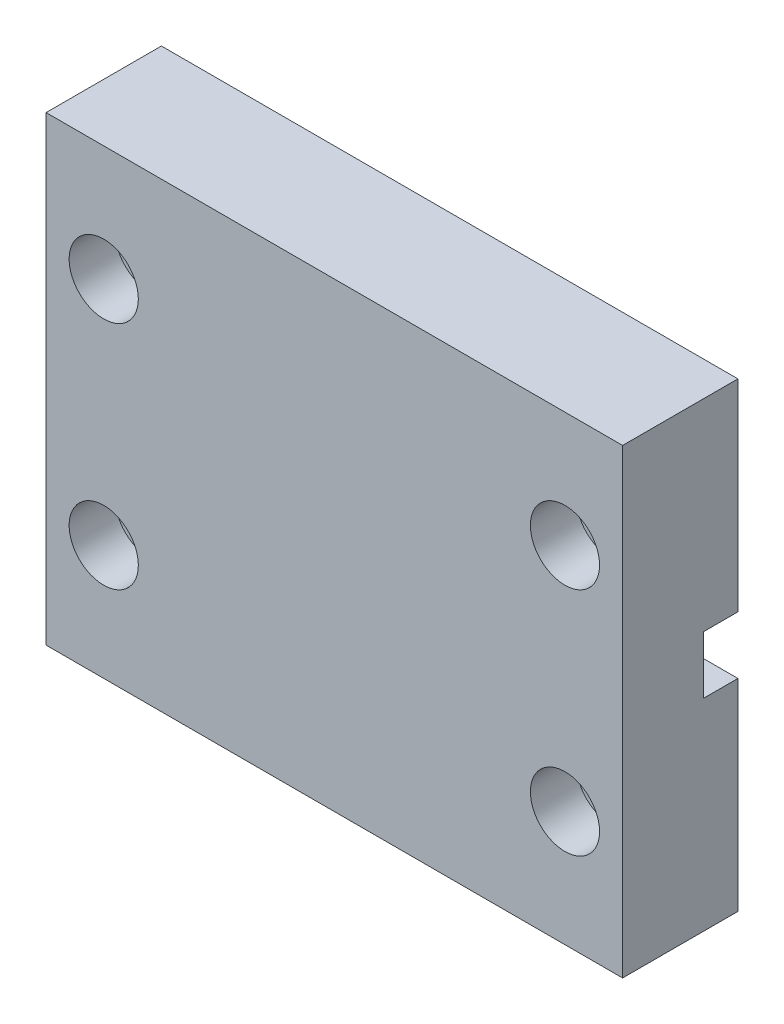
ISO-10303-21;
HEADER;
FILE_DESCRIPTION(('STEP AP214'),'2;1');
FILE_NAME('part.step','',(''),(''),'','','');
FILE_SCHEMA(('AUTOMOTIVE_DESIGN { 1 0 10303 214 1 1 1 1 }'));
ENDSEC;
DATA;
#1=APPLICATION_CONTEXT('core data for automotive mechanical design processes');
#2=APPLICATION_PROTOCOL_DEFINITION('international standard','automotive_design',2000,#1);
#3=PRODUCT_CONTEXT('',#1,'mechanical');
#4=PRODUCT('Part','Part','',(#3));
#5=PRODUCT_RELATED_PRODUCT_CATEGORY('part','',(#4));
#6=PRODUCT_DEFINITION_FORMATION('','',#4);
#7=PRODUCT_DEFINITION_CONTEXT('part definition',#1,'design');
#8=PRODUCT_DEFINITION('design','',#6,#7);
#9=PRODUCT_DEFINITION_SHAPE('','',#8);
#10=(LENGTH_UNIT() NAMED_UNIT(*) SI_UNIT(.MILLI.,.METRE.));
#11=(NAMED_UNIT(*) PLANE_ANGLE_UNIT() SI_UNIT($,.RADIAN.));
#12=(NAMED_UNIT(*) SI_UNIT($,.STERADIAN.) SOLID_ANGLE_UNIT());
#13=UNCERTAINTY_MEASURE_WITH_UNIT(LENGTH_MEASURE(1.E-05),#10,'distance_accuracy_value','');
#14=(GEOMETRIC_REPRESENTATION_CONTEXT(3) GLOBAL_UNCERTAINTY_ASSIGNED_CONTEXT((#13)) GLOBAL_UNIT_ASSIGNED_CONTEXT((#10,
#11,#12)) REPRESENTATION_CONTEXT('',''));
#15=CARTESIAN_POINT('',(0.,0.,0.));
#16=DIRECTION('',(0.,0.,1.));
#17=DIRECTION('',(1.,0.,0.));
#18=AXIS2_PLACEMENT_3D('',#15,#16,#17);
#19=CARTESIAN_POINT('',(4.55535961159553,20.8357520804533,26.2898446599827));
#20=DIRECTION('',(0.,0.,-1.));
#21=DIRECTION('',(-1.,0.,0.));
#22=AXIS2_PLACEMENT_3D('',#19,#20,#21);
#23=CYLINDRICAL_SURFACE('',#22,2.5);
#24=CARTESIAN_POINT('',(4.55535961159553,20.8357520804533,26.2898446599827));
#25=DIRECTION('',(0.,0.,-1.));
#26=DIRECTION('',(-1.,0.,0.));
#27=AXIS2_PLACEMENT_3D('',#24,#25,#26);
#28=CIRCLE('',#27,2.5);
#29=CARTESIAN_POINT('',(2.05535961159553,20.8357520804533,26.2898446599827));
#30=VERTEX_POINT('',#29);
#31=EDGE_CURVE('E177',#30,#30,#28,.T.);
#32=ORIENTED_EDGE('',*,*,#31,.F.);
#33=EDGE_LOOP('',(#32));
#34=FACE_BOUND('',#33,.T.);
#35=DIRECTION('',(0.,0.,-1.));
#36=VECTOR('',#35,1.);
#37=CARTESIAN_POINT('',(4.55535961159553,18.3357520804533,21.2898446599827));
#38=LINE('',#37,#36);
#39=CARTESIAN_POINT('',(4.55535961159553,18.3357520804533,21.2898446599827));
#40=VERTEX_POINT('',#39);
#41=CARTESIAN_POINT('',(4.55535961159553,18.3357520804533,18.2898446599827));
#42=VERTEX_POINT('',#41);
#43=EDGE_CURVE('E166',#40,#42,#38,.T.);
#44=ORIENTED_EDGE('',*,*,#43,.T.);
#45=CARTESIAN_POINT('',(4.55535961159553,20.8357520804533,18.2898446599827));
#46=DIRECTION('',(0.,0.,-1.));
#47=DIRECTION('',(-1.,0.,0.));
#48=AXIS2_PLACEMENT_3D('',#45,#46,#47);
#49=CIRCLE('',#48,2.5);
#50=CARTESIAN_POINT('',(4.55535961159553,23.3357520804533,18.2898446599827));
#51=VERTEX_POINT('',#50);
#52=EDGE_CURVE('E149',#42,#51,#49,.T.);
#53=ORIENTED_EDGE('',*,*,#52,.T.);
#54=DIRECTION('',(0.,0.,-1.));
#55=VECTOR('',#54,1.);
#56=CARTESIAN_POINT('',(4.55535961159553,23.3357520804533,21.2898446599827));
#57=LINE('',#56,#55);
#58=CARTESIAN_POINT('',(4.55535961159553,23.3357520804533,21.2898446599827));
#59=VERTEX_POINT('',#58);
#60=EDGE_CURVE('E140',#59,#51,#57,.T.);
#61=ORIENTED_EDGE('',*,*,#60,.F.);
#62=CARTESIAN_POINT('',(4.55535961159553,20.8357520804533,21.2898446599827));
#63=DIRECTION('',(0.,0.,1.));
#64=DIRECTION('',(1.,0.,0.));
#65=AXIS2_PLACEMENT_3D('',#62,#63,#64);
#66=CIRCLE('',#65,2.5);
#67=EDGE_CURVE('E13',#59,#40,#66,.F.);
#68=ORIENTED_EDGE('',*,*,#67,.T.);
#69=EDGE_LOOP('',(#44,#53,#61,#68));
#70=FACE_BOUND('',#69,.T.);
#71=ADVANCED_FACE('F44',(#34,#70),#23,.F.);
#72=CARTESIAN_POINT('',(-5.44464038840447,20.8357520804533,26.2898446599827));
#73=DIRECTION('',(0.,0.,-1.));
#74=DIRECTION('',(-1.,0.,0.));
#75=AXIS2_PLACEMENT_3D('',#72,#73,#74);
#76=CYLINDRICAL_SURFACE('',#75,2.5);
#77=CARTESIAN_POINT('',(-5.44464038840447,20.8357520804533,26.2898446599827));
#78=DIRECTION('',(0.,0.,-1.));
#79=DIRECTION('',(-1.,0.,0.));
#80=AXIS2_PLACEMENT_3D('',#77,#78,#79);
#81=CIRCLE('',#80,2.5);
#82=CARTESIAN_POINT('',(-7.94464038840447,20.8357520804533,26.2898446599827));
#83=VERTEX_POINT('',#82);
#84=EDGE_CURVE('E182',#83,#83,#81,.T.);
#85=ORIENTED_EDGE('',*,*,#84,.F.);
#86=EDGE_LOOP('',(#85));
#87=FACE_BOUND('',#86,.T.);
#88=DIRECTION('',(0.,0.,-1.));
#89=VECTOR('',#88,1.);
#90=CARTESIAN_POINT('',(-5.44464038840447,23.3357520804533,21.2898446599827));
#91=LINE('',#90,#89);
#92=CARTESIAN_POINT('',(-5.44464038840447,23.3357520804533,21.2898446599827));
#93=VERTEX_POINT('',#92);
#94=CARTESIAN_POINT('',(-5.44464038840447,23.3357520804533,18.2898446599827));
#95=VERTEX_POINT('',#94);
#96=EDGE_CURVE('E168',#93,#95,#91,.T.);
#97=ORIENTED_EDGE('',*,*,#96,.T.);
#98=CARTESIAN_POINT('',(-5.44464038840447,20.8357520804533,18.2898446599827));
#99=DIRECTION('',(0.,0.,-1.));
#100=DIRECTION('',(-1.,0.,0.));
#101=AXIS2_PLACEMENT_3D('',#98,#99,#100);
#102=CIRCLE('',#101,2.5);
#103=CARTESIAN_POINT('',(-5.44464038840447,18.3357520804533,18.2898446599827));
#104=VERTEX_POINT('',#103);
#105=EDGE_CURVE('E180',#95,#104,#102,.T.);
#106=ORIENTED_EDGE('',*,*,#105,.T.);
#107=DIRECTION('',(0.,0.,-1.));
#108=VECTOR('',#107,1.);
#109=CARTESIAN_POINT('',(-5.44464038840447,18.3357520804533,21.2898446599827));
#110=LINE('',#109,#108);
#111=CARTESIAN_POINT('',(-5.44464038840447,18.3357520804533,21.2898446599827));
#112=VERTEX_POINT('',#111);
#113=EDGE_CURVE('E163',#112,#104,#110,.T.);
#114=ORIENTED_EDGE('',*,*,#113,.F.);
#115=CARTESIAN_POINT('',(-5.44464038840447,20.8357520804533,21.2898446599827));
#116=DIRECTION('',(0.,0.,-1.));
#117=DIRECTION('',(-1.,0.,0.));
#118=AXIS2_PLACEMENT_3D('',#115,#116,#117);
#119=CIRCLE('',#118,2.5);
#120=EDGE_CURVE('E52',#93,#112,#119,.F.);
#121=ORIENTED_EDGE('',*,*,#120,.F.);
#122=EDGE_LOOP('',(#97,#106,#114,#121));
#123=FACE_BOUND('',#122,.T.);
#124=ADVANCED_FACE('F277',(#87,#123),#76,.F.);
#125=CARTESIAN_POINT('',(19.5553596115955,30.8357520804533,18.2888446599827));
#126=DIRECTION('',(0.,0.,1.));
#127=DIRECTION('',(1.,0.,0.));
#128=AXIS2_PLACEMENT_3D('',#125,#126,#127);
#129=CYLINDRICAL_SURFACE('',#128,1.75);
#130=CARTESIAN_POINT('',(19.5553596115955,30.8357520804533,18.2898446599827));
#131=DIRECTION('',(0.,0.,1.));
#132=DIRECTION('',(1.,0.,0.));
#133=AXIS2_PLACEMENT_3D('',#130,#131,#132);
#134=CIRCLE('',#133,1.75);
#135=CARTESIAN_POINT('',(21.3053596115955,30.8357520804533,18.2898446599827));
#136=VERTEX_POINT('',#135);
#137=EDGE_CURVE('E215',#136,#136,#134,.F.);
#138=ORIENTED_EDGE('',*,*,#137,.T.);
#139=EDGE_LOOP('',(#138));
#140=FACE_BOUND('',#139,.T.);
#141=CARTESIAN_POINT('',(19.5553596115955,30.8357520804533,24.2898446599827));
#142=DIRECTION('',(0.,0.,1.));
#143=DIRECTION('',(1.,0.,0.));
#144=AXIS2_PLACEMENT_3D('',#141,#142,#143);
#145=CIRCLE('',#144,1.75);
#146=CARTESIAN_POINT('',(21.3053596115955,30.8357520804533,24.2898446599827));
#147=VERTEX_POINT('',#146);
#148=EDGE_CURVE('E191',#147,#147,#145,.F.);
#149=ORIENTED_EDGE('',*,*,#148,.F.);
#150=EDGE_LOOP('',(#149));
#151=FACE_BOUND('',#150,.T.);
#152=ADVANCED_FACE('F303',(#140,#151),#129,.F.);
#153=CARTESIAN_POINT('',(19.5553596115955,10.8357520804533,18.2888446599827));
#154=DIRECTION('',(0.,0.,1.));
#155=DIRECTION('',(1.,0.,0.));
#156=AXIS2_PLACEMENT_3D('',#153,#154,#155);
#157=CYLINDRICAL_SURFACE('',#156,1.75);
#158=CARTESIAN_POINT('',(19.5553596115955,10.8357520804533,18.2898446599827));
#159=DIRECTION('',(0.,0.,1.));
#160=DIRECTION('',(1.,0.,0.));
#161=AXIS2_PLACEMENT_3D('',#158,#159,#160);
#162=CIRCLE('',#161,1.75);
#163=CARTESIAN_POINT('',(21.3053596115955,10.8357520804533,18.2898446599827));
#164=VERTEX_POINT('',#163);
#165=EDGE_CURVE('E218',#164,#164,#162,.F.);
#166=ORIENTED_EDGE('',*,*,#165,.T.);
#167=EDGE_LOOP('',(#166));
#168=FACE_BOUND('',#167,.T.);
#169=CARTESIAN_POINT('',(19.5553596115955,10.8357520804533,24.2898446599827));
#170=DIRECTION('',(0.,0.,1.));
#171=DIRECTION('',(1.,0.,0.));
#172=AXIS2_PLACEMENT_3D('',#169,#170,#171);
#173=CIRCLE('',#172,1.75);
#174=CARTESIAN_POINT('',(21.3053596115955,10.8357520804533,24.2898446599827));
#175=VERTEX_POINT('',#174);
#176=EDGE_CURVE('E197',#175,#175,#173,.F.);
#177=ORIENTED_EDGE('',*,*,#176,.F.);
#178=EDGE_LOOP('',(#177));
#179=FACE_BOUND('',#178,.T.);
#180=ADVANCED_FACE('F348',(#168,#179),#157,.F.);
#181=CARTESIAN_POINT('',(-20.4446403884045,10.8357520804533,18.2888446599827));
#182=DIRECTION('',(0.,0.,1.));
#183=DIRECTION('',(1.,0.,0.));
#184=AXIS2_PLACEMENT_3D('',#181,#182,#183);
#185=CYLINDRICAL_SURFACE('',#184,1.75);
#186=CARTESIAN_POINT('',(-20.4446403884045,10.8357520804533,18.2898446599827));
#187=DIRECTION('',(0.,0.,1.));
#188=DIRECTION('',(1.,0.,0.));
#189=AXIS2_PLACEMENT_3D('',#186,#187,#188);
#190=CIRCLE('',#189,1.75);
#191=CARTESIAN_POINT('',(-18.6946403884045,10.8357520804533,18.2898446599827));
#192=VERTEX_POINT('',#191);
#193=EDGE_CURVE('E221',#192,#192,#190,.F.);
#194=ORIENTED_EDGE('',*,*,#193,.T.);
#195=EDGE_LOOP('',(#194));
#196=FACE_BOUND('',#195,.T.);
#197=CARTESIAN_POINT('',(-20.4446403884045,10.8357520804533,24.2898446599827));
#198=DIRECTION('',(0.,0.,1.));
#199=DIRECTION('',(1.,0.,0.));
#200=AXIS2_PLACEMENT_3D('',#197,#198,#199);
#201=CIRCLE('',#200,1.75);
#202=CARTESIAN_POINT('',(-18.6946403884045,10.8357520804533,24.2898446599827));
#203=VERTEX_POINT('',#202);
#204=EDGE_CURVE('E204',#203,#203,#201,.F.);
#205=ORIENTED_EDGE('',*,*,#204,.F.);
#206=EDGE_LOOP('',(#205));
#207=FACE_BOUND('',#206,.T.);
#208=ADVANCED_FACE('F352',(#196,#207),#185,.F.);
#209=CARTESIAN_POINT('',(-20.4446403884045,30.8357520804533,18.2888446599827));
#210=DIRECTION('',(0.,0.,1.));
#211=DIRECTION('',(1.,0.,0.));
#212=AXIS2_PLACEMENT_3D('',#209,#210,#211);
#213=CYLINDRICAL_SURFACE('',#212,1.75);
#214=CARTESIAN_POINT('',(-20.4446403884045,30.8357520804533,18.2898446599827));
#215=DIRECTION('',(0.,0.,1.));
#216=DIRECTION('',(1.,0.,0.));
#217=AXIS2_PLACEMENT_3D('',#214,#215,#216);
#218=CIRCLE('',#217,1.75);
#219=CARTESIAN_POINT('',(-18.6946403884045,30.8357520804533,18.2898446599827));
#220=VERTEX_POINT('',#219);
#221=EDGE_CURVE('E224',#220,#220,#218,.F.);
#222=ORIENTED_EDGE('',*,*,#221,.T.);
#223=EDGE_LOOP('',(#222));
#224=FACE_BOUND('',#223,.T.);
#225=CARTESIAN_POINT('',(-20.4446403884045,30.8357520804533,24.2898446599827));
#226=DIRECTION('',(0.,0.,1.));
#227=DIRECTION('',(1.,0.,0.));
#228=AXIS2_PLACEMENT_3D('',#225,#226,#227);
#229=CIRCLE('',#228,1.75);
#230=CARTESIAN_POINT('',(-18.6946403884045,30.8357520804533,24.2898446599827));
#231=VERTEX_POINT('',#230);
#232=EDGE_CURVE('E211',#231,#231,#229,.F.);
#233=ORIENTED_EDGE('',*,*,#232,.F.);
#234=EDGE_LOOP('',(#233));
#235=FACE_BOUND('',#234,.T.);
#236=ADVANCED_FACE('F356',(#224,#235),#213,.F.);
#237=CARTESIAN_POINT('',(-25.4446403884045,40.8357520804533,18.2898446599827));
#238=DIRECTION('',(1.,0.,0.));
#239=DIRECTION('',(0.,0.,-1.));
#240=AXIS2_PLACEMENT_3D('',#237,#238,#239);
#241=PLANE('',#240);
#242=DIRECTION('',(0.,-1.,0.));
#243=VECTOR('',#242,1.);
#244=CARTESIAN_POINT('',(-25.4446403884045,40.8357520804533,18.2898446599827));
#245=LINE('',#244,#243);
#246=CARTESIAN_POINT('',(-25.4446403884045,40.8357520804533,18.2898446599827));
#247=VERTEX_POINT('',#246);
#248=CARTESIAN_POINT('',(-25.4446403884045,23.3357520804533,18.2898446599827));
#249=VERTEX_POINT('',#248);
#250=EDGE_CURVE('E248',#247,#249,#245,.T.);
#251=ORIENTED_EDGE('',*,*,#250,.T.);
#252=DIRECTION('',(0.,0.,-1.));
#253=VECTOR('',#252,1.);
#254=CARTESIAN_POINT('',(-25.4446403884045,23.3357520804533,21.2898446599827));
#255=LINE('',#254,#253);
#256=CARTESIAN_POINT('',(-25.4446403884045,23.3357520804533,21.2898446599827));
#257=VERTEX_POINT('',#256);
#258=EDGE_CURVE('E171',#257,#249,#255,.T.);
#259=ORIENTED_EDGE('',*,*,#258,.F.);
#260=DIRECTION('',(0.,1.,0.));
#261=VECTOR('',#260,1.);
#262=CARTESIAN_POINT('',(-25.4446403884045,23.3357520804533,21.2898446599827));
#263=LINE('',#262,#261);
#264=CARTESIAN_POINT('',(-25.4446403884045,18.3357520804533,21.2898446599827));
#265=VERTEX_POINT('',#264);
#266=EDGE_CURVE('E159',#265,#257,#263,.T.);
#267=ORIENTED_EDGE('',*,*,#266,.F.);
#268=DIRECTION('',(0.,0.,-1.));
#269=VECTOR('',#268,1.);
#270=CARTESIAN_POINT('',(-25.4446403884045,18.3357520804533,21.2898446599827));
#271=LINE('',#270,#269);
#272=CARTESIAN_POINT('',(-25.4446403884045,18.3357520804533,18.2898446599827));
#273=VERTEX_POINT('',#272);
#274=EDGE_CURVE('E173',#265,#273,#271,.T.);
#275=ORIENTED_EDGE('',*,*,#274,.T.);
#276=CARTESIAN_POINT('',(-25.4446403884045,0.835752080453274,18.2898446599827));
#277=VERTEX_POINT('',#276);
#278=EDGE_CURVE('E238',#273,#277,#245,.T.);
#279=ORIENTED_EDGE('',*,*,#278,.T.);
#280=DIRECTION('',(0.,0.,1.));
#281=VECTOR('',#280,1.);
#282=CARTESIAN_POINT('',(-25.4446403884045,0.835752080453274,18.2898446599827));
#283=LINE('',#282,#281);
#284=CARTESIAN_POINT('',(-25.4446403884045,0.835752080453274,28.2898446599827));
#285=VERTEX_POINT('',#284);
#286=EDGE_CURVE('E227',#277,#285,#283,.T.);
#287=ORIENTED_EDGE('',*,*,#286,.T.);
#288=DIRECTION('',(0.,-1.,0.));
#289=VECTOR('',#288,1.);
#290=CARTESIAN_POINT('',(-25.4446403884045,40.8357520804533,28.2898446599827));
#291=LINE('',#290,#289);
#292=CARTESIAN_POINT('',(-25.4446403884045,40.8357520804533,28.2898446599827));
#293=VERTEX_POINT('',#292);
#294=EDGE_CURVE('E258',#293,#285,#291,.T.);
#295=ORIENTED_EDGE('',*,*,#294,.F.);
#296=DIRECTION('',(0.,0.,1.));
#297=VECTOR('',#296,1.);
#298=CARTESIAN_POINT('',(-25.4446403884045,40.8357520804533,18.2898446599827));
#299=LINE('',#298,#297);
#300=EDGE_CURVE('E228',#247,#293,#299,.T.);
#301=ORIENTED_EDGE('',*,*,#300,.F.);
#302=EDGE_LOOP('',(#251,#259,#267,#275,#279,#287,#295,#301));
#303=FACE_BOUND('',#302,.T.);
#304=ADVANCED_FACE('F46',(#303),#241,.F.);
#305=CARTESIAN_POINT('',(-25.4446403884045,40.8357520804533,28.2898446599827));
#306=DIRECTION('',(0.,0.,-1.));
#307=DIRECTION('',(-1.,0.,0.));
#308=AXIS2_PLACEMENT_3D('',#305,#306,#307);
#309=PLANE('',#308);
#310=CARTESIAN_POINT('',(19.5553596115955,30.8357520804533,28.2898446599827));
#311=DIRECTION('',(0.,0.,1.));
#312=DIRECTION('',(1.,0.,0.));
#313=AXIS2_PLACEMENT_3D('',#310,#311,#312);
#314=CIRCLE('',#313,3.);
#315=CARTESIAN_POINT('',(22.5553596115955,30.8357520804533,28.2898446599827));
#316=VERTEX_POINT('',#315);
#317=EDGE_CURVE('E185',#316,#316,#314,.T.);
#318=ORIENTED_EDGE('',*,*,#317,.F.);
#319=EDGE_LOOP('',(#318));
#320=FACE_BOUND('',#319,.T.);
#321=CARTESIAN_POINT('',(19.5553596115955,10.8357520804533,28.2898446599827));
#322=DIRECTION('',(0.,0.,1.));
#323=DIRECTION('',(1.,0.,0.));
#324=AXIS2_PLACEMENT_3D('',#321,#322,#323);
#325=CIRCLE('',#324,3.);
#326=CARTESIAN_POINT('',(22.5553596115955,10.8357520804533,28.2898446599827));
#327=VERTEX_POINT('',#326);
#328=EDGE_CURVE('E198',#327,#327,#325,.T.);
#329=ORIENTED_EDGE('',*,*,#328,.F.);
#330=EDGE_LOOP('',(#329));
#331=FACE_BOUND('',#330,.T.);
#332=CARTESIAN_POINT('',(-20.4446403884045,10.8357520804533,28.2898446599827));
#333=DIRECTION('',(0.,0.,1.));
#334=DIRECTION('',(1.,0.,0.));
#335=AXIS2_PLACEMENT_3D('',#332,#333,#334);
#336=CIRCLE('',#335,3.);
#337=CARTESIAN_POINT('',(-17.4446403884045,10.8357520804533,28.2898446599827));
#338=VERTEX_POINT('',#337);
#339=EDGE_CURVE('E205',#338,#338,#336,.T.);
#340=ORIENTED_EDGE('',*,*,#339,.F.);
#341=EDGE_LOOP('',(#340));
#342=FACE_BOUND('',#341,.T.);
#343=CARTESIAN_POINT('',(-20.4446403884045,30.8357520804533,28.2898446599827));
#344=DIRECTION('',(0.,0.,1.));
#345=DIRECTION('',(1.,0.,0.));
#346=AXIS2_PLACEMENT_3D('',#343,#344,#345);
#347=CIRCLE('',#346,3.);
#348=CARTESIAN_POINT('',(-17.4446403884045,30.8357520804533,28.2898446599827));
#349=VERTEX_POINT('',#348);
#350=EDGE_CURVE('E212',#349,#349,#347,.T.);
#351=ORIENTED_EDGE('',*,*,#350,.F.);
#352=EDGE_LOOP('',(#351));
#353=FACE_BOUND('',#352,.T.);
#354=DIRECTION('',(1.,0.,0.));
#355=VECTOR('',#354,1.);
#356=CARTESIAN_POINT('',(-25.4446403884045,0.835752080453274,28.2898446599827));
#357=LINE('',#356,#355);
#358=CARTESIAN_POINT('',(24.5553596115955,0.835752080453274,28.2898446599827));
#359=VERTEX_POINT('',#358);
#360=EDGE_CURVE('E241',#285,#359,#357,.T.);
#361=ORIENTED_EDGE('',*,*,#360,.T.);
#362=DIRECTION('',(0.,-1.,0.));
#363=VECTOR('',#362,1.);
#364=CARTESIAN_POINT('',(24.5553596115955,40.8357520804533,28.2898446599827));
#365=LINE('',#364,#363);
#366=CARTESIAN_POINT('',(24.5553596115955,40.8357520804533,28.2898446599827));
#367=VERTEX_POINT('',#366);
#368=EDGE_CURVE('E255',#367,#359,#365,.T.);
#369=ORIENTED_EDGE('',*,*,#368,.F.);
#370=DIRECTION('',(1.,0.,0.));
#371=VECTOR('',#370,1.);
#372=CARTESIAN_POINT('',(-25.4446403884045,40.8357520804533,28.2898446599827));
#373=LINE('',#372,#371);
#374=EDGE_CURVE('E231',#293,#367,#373,.T.);
#375=ORIENTED_EDGE('',*,*,#374,.F.);
#376=ORIENTED_EDGE('',*,*,#294,.T.);
#377=EDGE_LOOP('',(#361,#369,#375,#376));
#378=FACE_BOUND('',#377,.T.);
#379=ADVANCED_FACE('F373',(#320,#331,#342,#353,#378),#309,.F.);
#380=CARTESIAN_POINT('',(24.5553596115955,40.8357520804533,18.2898446599827));
#381=DIRECTION('',(-1.,0.,0.));
#382=DIRECTION('',(0.,0.,1.));
#383=AXIS2_PLACEMENT_3D('',#380,#381,#382);
#384=PLANE('',#383);
#385=DIRECTION('',(0.,-1.,0.));
#386=VECTOR('',#385,1.);
#387=CARTESIAN_POINT('',(24.5553596115955,40.8357520804533,18.2898446599827));
#388=LINE('',#387,#386);
#389=CARTESIAN_POINT('',(24.5553596115955,18.3357520804533,18.2898446599827));
#390=VERTEX_POINT('',#389);
#391=CARTESIAN_POINT('',(24.5553596115955,0.835752080453274,18.2898446599827));
#392=VERTEX_POINT('',#391);
#393=EDGE_CURVE('E251',#390,#392,#388,.T.);
#394=ORIENTED_EDGE('',*,*,#393,.F.);
#395=DIRECTION('',(0.,0.,-1.));
#396=VECTOR('',#395,1.);
#397=CARTESIAN_POINT('',(24.5553596115955,18.3357520804533,21.2898446599827));
#398=LINE('',#397,#396);
#399=CARTESIAN_POINT('',(24.5553596115955,18.3357520804533,21.2898446599827));
#400=VERTEX_POINT('',#399);
#401=EDGE_CURVE('E151',#400,#390,#398,.T.);
#402=ORIENTED_EDGE('',*,*,#401,.F.);
#403=DIRECTION('',(0.,-1.,0.));
#404=VECTOR('',#403,1.);
#405=CARTESIAN_POINT('',(24.5553596115955,23.3357520804533,21.2898446599827));
#406=LINE('',#405,#404);
#407=CARTESIAN_POINT('',(24.5553596115955,23.3357520804533,21.2898446599827));
#408=VERTEX_POINT('',#407);
#409=EDGE_CURVE('E144',#408,#400,#406,.T.);
#410=ORIENTED_EDGE('',*,*,#409,.F.);
#411=DIRECTION('',(0.,0.,-1.));
#412=VECTOR('',#411,1.);
#413=CARTESIAN_POINT('',(24.5553596115955,23.3357520804533,21.2898446599827));
#414=LINE('',#413,#412);
#415=CARTESIAN_POINT('',(24.5553596115955,23.3357520804533,18.2898446599827));
#416=VERTEX_POINT('',#415);
#417=EDGE_CURVE('E143',#408,#416,#414,.T.);
#418=ORIENTED_EDGE('',*,*,#417,.T.);
#419=CARTESIAN_POINT('',(24.5553596115955,40.8357520804533,18.2898446599827));
#420=VERTEX_POINT('',#419);
#421=EDGE_CURVE('E252',#420,#416,#388,.T.);
#422=ORIENTED_EDGE('',*,*,#421,.F.);
#423=DIRECTION('',(0.,0.,-1.));
#424=VECTOR('',#423,1.);
#425=CARTESIAN_POINT('',(24.5553596115955,40.8357520804533,18.2898446599827));
#426=LINE('',#425,#424);
#427=EDGE_CURVE('E234',#367,#420,#426,.T.);
#428=ORIENTED_EDGE('',*,*,#427,.F.);
#429=ORIENTED_EDGE('',*,*,#368,.T.);
#430=DIRECTION('',(0.,0.,-1.));
#431=VECTOR('',#430,1.);
#432=CARTESIAN_POINT('',(24.5553596115955,0.835752080453274,18.2898446599827));
#433=LINE('',#432,#431);
#434=EDGE_CURVE('E243',#359,#392,#433,.T.);
#435=ORIENTED_EDGE('',*,*,#434,.T.);
#436=EDGE_LOOP('',(#394,#402,#410,#418,#422,#428,#429,#435));
#437=FACE_BOUND('',#436,.T.);
#438=ADVANCED_FACE('F370',(#437),#384,.F.);
#439=CARTESIAN_POINT('',(-25.4446403884045,40.8357520804533,18.2898446599827));
#440=DIRECTION('',(0.,0.,1.));
#441=DIRECTION('',(1.,0.,0.));
#442=AXIS2_PLACEMENT_3D('',#439,#440,#441);
#443=PLANE('',#442);
#444=ORIENTED_EDGE('',*,*,#137,.F.);
#445=EDGE_LOOP('',(#444));
#446=FACE_BOUND('',#445,.T.);
#447=ORIENTED_EDGE('',*,*,#165,.F.);
#448=EDGE_LOOP('',(#447));
#449=FACE_BOUND('',#448,.T.);
#450=ORIENTED_EDGE('',*,*,#193,.F.);
#451=EDGE_LOOP('',(#450));
#452=FACE_BOUND('',#451,.T.);
#453=ORIENTED_EDGE('',*,*,#221,.F.);
#454=EDGE_LOOP('',(#453));
#455=FACE_BOUND('',#454,.T.);
#456=ORIENTED_EDGE('',*,*,#52,.F.);
#457=DIRECTION('',(-1.,0.,0.));
#458=VECTOR('',#457,1.);
#459=CARTESIAN_POINT('',(4.55535961159553,18.3357520804533,18.2898446599827));
#460=LINE('',#459,#458);
#461=EDGE_CURVE('E145',#390,#42,#460,.T.);
#462=ORIENTED_EDGE('',*,*,#461,.F.);
#463=ORIENTED_EDGE('',*,*,#393,.T.);
#464=DIRECTION('',(-1.,0.,0.));
#465=VECTOR('',#464,1.);
#466=CARTESIAN_POINT('',(-25.4446403884045,0.835752080453274,18.2898446599827));
#467=LINE('',#466,#465);
#468=EDGE_CURVE('E232',#392,#277,#467,.T.);
#469=ORIENTED_EDGE('',*,*,#468,.T.);
#470=ORIENTED_EDGE('',*,*,#278,.F.);
#471=DIRECTION('',(-1.,0.,0.));
#472=VECTOR('',#471,1.);
#473=CARTESIAN_POINT('',(-5.44464038840447,18.3357520804533,18.2898446599827));
#474=LINE('',#473,#472);
#475=EDGE_CURVE('E164',#104,#273,#474,.T.);
#476=ORIENTED_EDGE('',*,*,#475,.F.);
#477=ORIENTED_EDGE('',*,*,#105,.F.);
#478=DIRECTION('',(1.,0.,0.));
#479=VECTOR('',#478,1.);
#480=CARTESIAN_POINT('',(-5.44464038840447,23.3357520804533,18.2898446599827));
#481=LINE('',#480,#479);
#482=EDGE_CURVE('E160',#249,#95,#481,.T.);
#483=ORIENTED_EDGE('',*,*,#482,.F.);
#484=ORIENTED_EDGE('',*,*,#250,.F.);
#485=DIRECTION('',(-1.,0.,0.));
#486=VECTOR('',#485,1.);
#487=CARTESIAN_POINT('',(-25.4446403884045,40.8357520804533,18.2898446599827));
#488=LINE('',#487,#486);
#489=EDGE_CURVE('E236',#420,#247,#488,.T.);
#490=ORIENTED_EDGE('',*,*,#489,.F.);
#491=ORIENTED_EDGE('',*,*,#421,.T.);
#492=DIRECTION('',(1.,0.,0.));
#493=VECTOR('',#492,1.);
#494=CARTESIAN_POINT('',(4.55535961159553,23.3357520804533,18.2898446599827));
#495=LINE('',#494,#493);
#496=EDGE_CURVE('E402',#51,#416,#495,.T.);
#497=ORIENTED_EDGE('',*,*,#496,.F.);
#498=EDGE_LOOP('',(#456,#462,#463,#469,#470,#476,#477,#483,#484,#490,#491,#497));
#499=FACE_BOUND('',#498,.T.);
#500=ADVANCED_FACE('F281',(#446,#449,#452,#455,#499),#443,.F.);
#501=CARTESIAN_POINT('',(-25.4446403884045,40.8357520804533,28.2898446599827));
#502=DIRECTION('',(0.,1.,0.));
#503=DIRECTION('',(0.,0.,1.));
#504=AXIS2_PLACEMENT_3D('',#501,#502,#503);
#505=PLANE('',#504);
#506=ORIENTED_EDGE('',*,*,#300,.T.);
#507=ORIENTED_EDGE('',*,*,#374,.T.);
#508=ORIENTED_EDGE('',*,*,#427,.T.);
#509=ORIENTED_EDGE('',*,*,#489,.T.);
#510=EDGE_LOOP('',(#506,#507,#508,#509));
#511=FACE_BOUND('',#510,.T.);
#512=ADVANCED_FACE('F361',(#511),#505,.T.);
#513=CARTESIAN_POINT('',(-25.4446403884045,0.835752080453274,28.2898446599827));
#514=DIRECTION('',(0.,1.,0.));
#515=DIRECTION('',(0.,0.,1.));
#516=AXIS2_PLACEMENT_3D('',#513,#514,#515);
#517=PLANE('',#516);
#518=ORIENTED_EDGE('',*,*,#286,.F.);
#519=ORIENTED_EDGE('',*,*,#468,.F.);
#520=ORIENTED_EDGE('',*,*,#434,.F.);
#521=ORIENTED_EDGE('',*,*,#360,.F.);
#522=EDGE_LOOP('',(#518,#519,#520,#521));
#523=FACE_BOUND('',#522,.T.);
#524=ADVANCED_FACE('F341',(#523),#517,.F.);
#525=CARTESIAN_POINT('',(-20.4446403884045,30.8357520804533,24.2898446599827));
#526=DIRECTION('',(0.,0.,1.));
#527=DIRECTION('',(1.,0.,0.));
#528=AXIS2_PLACEMENT_3D('',#525,#526,#527);
#529=PLANE('',#528);
#530=CARTESIAN_POINT('',(-20.4446403884045,30.8357520804533,24.2898446599827));
#531=DIRECTION('',(0.,0.,1.));
#532=DIRECTION('',(1.,0.,0.));
#533=AXIS2_PLACEMENT_3D('',#530,#531,#532);
#534=CIRCLE('',#533,3.);
#535=CARTESIAN_POINT('',(-17.4446403884045,30.8357520804533,24.2898446599827));
#536=VERTEX_POINT('',#535);
#537=EDGE_CURVE('E208',#536,#536,#534,.T.);
#538=ORIENTED_EDGE('',*,*,#537,.T.);
#539=EDGE_LOOP('',(#538));
#540=FACE_BOUND('',#539,.T.);
#541=ORIENTED_EDGE('',*,*,#232,.T.);
#542=EDGE_LOOP('',(#541));
#543=FACE_BOUND('',#542,.T.);
#544=ADVANCED_FACE('F338',(#540,#543),#529,.T.);
#545=CARTESIAN_POINT('',(-20.4446403884045,30.8357520804533,24.2898446599827));
#546=DIRECTION('',(0.,0.,1.));
#547=DIRECTION('',(1.,0.,0.));
#548=AXIS2_PLACEMENT_3D('',#545,#546,#547);
#549=CYLINDRICAL_SURFACE('',#548,3.);
#550=ORIENTED_EDGE('',*,*,#537,.F.);
#551=EDGE_LOOP('',(#550));
#552=FACE_BOUND('',#551,.T.);
#553=ORIENTED_EDGE('',*,*,#350,.T.);
#554=EDGE_LOOP('',(#553));
#555=FACE_BOUND('',#554,.T.);
#556=ADVANCED_FACE('F333',(#552,#555),#549,.F.);
#557=CARTESIAN_POINT('',(-20.4446403884045,10.8357520804533,24.2898446599827));
#558=DIRECTION('',(0.,0.,1.));
#559=DIRECTION('',(1.,0.,0.));
#560=AXIS2_PLACEMENT_3D('',#557,#558,#559);
#561=PLANE('',#560);
#562=CARTESIAN_POINT('',(-20.4446403884045,10.8357520804533,24.2898446599827));
#563=DIRECTION('',(0.,0.,1.));
#564=DIRECTION('',(1.,0.,0.));
#565=AXIS2_PLACEMENT_3D('',#562,#563,#564);
#566=CIRCLE('',#565,3.);
#567=CARTESIAN_POINT('',(-17.4446403884045,10.8357520804533,24.2898446599827));
#568=VERTEX_POINT('',#567);
#569=EDGE_CURVE('E201',#568,#568,#566,.T.);
#570=ORIENTED_EDGE('',*,*,#569,.T.);
#571=EDGE_LOOP('',(#570));
#572=FACE_BOUND('',#571,.T.);
#573=ORIENTED_EDGE('',*,*,#204,.T.);
#574=EDGE_LOOP('',(#573));
#575=FACE_BOUND('',#574,.T.);
#576=ADVANCED_FACE('F330',(#572,#575),#561,.T.);
#577=CARTESIAN_POINT('',(-20.4446403884045,10.8357520804533,24.2898446599827));
#578=DIRECTION('',(0.,0.,1.));
#579=DIRECTION('',(1.,0.,0.));
#580=AXIS2_PLACEMENT_3D('',#577,#578,#579);
#581=CYLINDRICAL_SURFACE('',#580,3.);
#582=ORIENTED_EDGE('',*,*,#569,.F.);
#583=EDGE_LOOP('',(#582));
#584=FACE_BOUND('',#583,.T.);
#585=ORIENTED_EDGE('',*,*,#339,.T.);
#586=EDGE_LOOP('',(#585));
#587=FACE_BOUND('',#586,.T.);
#588=ADVANCED_FACE('F325',(#584,#587),#581,.F.);
#589=CARTESIAN_POINT('',(19.5553596115955,10.8357520804533,24.2898446599827));
#590=DIRECTION('',(0.,0.,1.));
#591=DIRECTION('',(1.,0.,0.));
#592=AXIS2_PLACEMENT_3D('',#589,#590,#591);
#593=PLANE('',#592);
#594=CARTESIAN_POINT('',(19.5553596115955,10.8357520804533,24.2898446599827));
#595=DIRECTION('',(0.,0.,1.));
#596=DIRECTION('',(1.,0.,0.));
#597=AXIS2_PLACEMENT_3D('',#594,#595,#596);
#598=CIRCLE('',#597,3.);
#599=CARTESIAN_POINT('',(22.5553596115955,10.8357520804533,24.2898446599827));
#600=VERTEX_POINT('',#599);
#601=EDGE_CURVE('E194',#600,#600,#598,.T.);
#602=ORIENTED_EDGE('',*,*,#601,.T.);
#603=EDGE_LOOP('',(#602));
#604=FACE_BOUND('',#603,.T.);
#605=ORIENTED_EDGE('',*,*,#176,.T.);
#606=EDGE_LOOP('',(#605));
#607=FACE_BOUND('',#606,.T.);
#608=ADVANCED_FACE('F322',(#604,#607),#593,.T.);
#609=CARTESIAN_POINT('',(19.5553596115955,10.8357520804533,24.2898446599827));
#610=DIRECTION('',(0.,0.,1.));
#611=DIRECTION('',(1.,0.,0.));
#612=AXIS2_PLACEMENT_3D('',#609,#610,#611);
#613=CYLINDRICAL_SURFACE('',#612,3.);
#614=ORIENTED_EDGE('',*,*,#601,.F.);
#615=EDGE_LOOP('',(#614));
#616=FACE_BOUND('',#615,.T.);
#617=ORIENTED_EDGE('',*,*,#328,.T.);
#618=EDGE_LOOP('',(#617));
#619=FACE_BOUND('',#618,.T.);
#620=ADVANCED_FACE('F317',(#616,#619),#613,.F.);
#621=CARTESIAN_POINT('',(19.5553596115955,30.8357520804533,24.2898446599827));
#622=DIRECTION('',(0.,0.,1.));
#623=DIRECTION('',(1.,0.,0.));
#624=AXIS2_PLACEMENT_3D('',#621,#622,#623);
#625=PLANE('',#624);
#626=CARTESIAN_POINT('',(19.5553596115955,30.8357520804533,24.2898446599827));
#627=DIRECTION('',(0.,0.,1.));
#628=DIRECTION('',(1.,0.,0.));
#629=AXIS2_PLACEMENT_3D('',#626,#627,#628);
#630=CIRCLE('',#629,3.);
#631=CARTESIAN_POINT('',(22.5553596115955,30.8357520804533,24.2898446599827));
#632=VERTEX_POINT('',#631);
#633=EDGE_CURVE('E188',#632,#632,#630,.T.);
#634=ORIENTED_EDGE('',*,*,#633,.T.);
#635=EDGE_LOOP('',(#634));
#636=FACE_BOUND('',#635,.T.);
#637=ORIENTED_EDGE('',*,*,#148,.T.);
#638=EDGE_LOOP('',(#637));
#639=FACE_BOUND('',#638,.T.);
#640=ADVANCED_FACE('F314',(#636,#639),#625,.T.);
#641=CARTESIAN_POINT('',(19.5553596115955,30.8357520804533,24.2898446599827));
#642=DIRECTION('',(0.,0.,1.));
#643=DIRECTION('',(1.,0.,0.));
#644=AXIS2_PLACEMENT_3D('',#641,#642,#643);
#645=CYLINDRICAL_SURFACE('',#644,3.);
#646=ORIENTED_EDGE('',*,*,#633,.F.);
#647=EDGE_LOOP('',(#646));
#648=FACE_BOUND('',#647,.T.);
#649=ORIENTED_EDGE('',*,*,#317,.T.);
#650=EDGE_LOOP('',(#649));
#651=FACE_BOUND('',#650,.T.);
#652=ADVANCED_FACE('F311',(#648,#651),#645,.F.);
#653=CARTESIAN_POINT('',(-5.44464038840447,20.8357520804533,26.2898446599827));
#654=DIRECTION('',(0.,0.,-1.));
#655=DIRECTION('',(-1.,0.,0.));
#656=AXIS2_PLACEMENT_3D('',#653,#654,#655);
#657=PLANE('',#656);
#658=ORIENTED_EDGE('',*,*,#84,.T.);
#659=EDGE_LOOP('',(#658));
#660=FACE_BOUND('',#659,.T.);
#661=ADVANCED_FACE('F309',(#660),#657,.T.);
#662=CARTESIAN_POINT('',(4.55535961159553,20.8357520804533,26.2898446599827));
#663=DIRECTION('',(0.,0.,-1.));
#664=DIRECTION('',(-1.,0.,0.));
#665=AXIS2_PLACEMENT_3D('',#662,#663,#664);
#666=PLANE('',#665);
#667=ORIENTED_EDGE('',*,*,#31,.T.);
#668=EDGE_LOOP('',(#667));
#669=FACE_BOUND('',#668,.T.);
#670=ADVANCED_FACE('F295',(#669),#666,.T.);
#671=CARTESIAN_POINT('',(-5.44464038840447,18.3357520804533,21.2898446599827));
#672=DIRECTION('',(0.,0.,-1.));
#673=DIRECTION('',(-1.,0.,0.));
#674=AXIS2_PLACEMENT_3D('',#671,#672,#673);
#675=PLANE('',#674);
#676=ORIENTED_EDGE('',*,*,#120,.T.);
#677=DIRECTION('',(-1.,0.,0.));
#678=VECTOR('',#677,1.);
#679=CARTESIAN_POINT('',(-5.44464038840447,18.3357520804533,21.2898446599827));
#680=LINE('',#679,#678);
#681=EDGE_CURVE('E156',#112,#265,#680,.T.);
#682=ORIENTED_EDGE('',*,*,#681,.T.);
#683=ORIENTED_EDGE('',*,*,#266,.T.);
#684=DIRECTION('',(1.,0.,0.));
#685=VECTOR('',#684,1.);
#686=CARTESIAN_POINT('',(-5.44464038840447,23.3357520804533,21.2898446599827));
#687=LINE('',#686,#685);
#688=EDGE_CURVE('E67',#257,#93,#687,.T.);
#689=ORIENTED_EDGE('',*,*,#688,.T.);
#690=EDGE_LOOP('',(#676,#682,#683,#689));
#691=FACE_BOUND('',#690,.T.);
#692=ADVANCED_FACE('F270',(#691),#675,.T.);
#693=CARTESIAN_POINT('',(-5.44464038840447,23.3357520804533,21.2898446599827));
#694=DIRECTION('',(0.,1.,0.));
#695=DIRECTION('',(0.,0.,1.));
#696=AXIS2_PLACEMENT_3D('',#693,#694,#695);
#697=PLANE('',#696);
#698=ORIENTED_EDGE('',*,*,#482,.T.);
#699=ORIENTED_EDGE('',*,*,#96,.F.);
#700=ORIENTED_EDGE('',*,*,#688,.F.);
#701=ORIENTED_EDGE('',*,*,#258,.T.);
#702=EDGE_LOOP('',(#698,#699,#700,#701));
#703=FACE_BOUND('',#702,.T.);
#704=ADVANCED_FACE('F287',(#703),#697,.F.);
#705=CARTESIAN_POINT('',(-5.44464038840447,18.3357520804533,21.2898446599827));
#706=DIRECTION('',(0.,-1.,0.));
#707=DIRECTION('',(0.,0.,-1.));
#708=AXIS2_PLACEMENT_3D('',#705,#706,#707);
#709=PLANE('',#708);
#710=ORIENTED_EDGE('',*,*,#475,.T.);
#711=ORIENTED_EDGE('',*,*,#274,.F.);
#712=ORIENTED_EDGE('',*,*,#681,.F.);
#713=ORIENTED_EDGE('',*,*,#113,.T.);
#714=EDGE_LOOP('',(#710,#711,#712,#713));
#715=FACE_BOUND('',#714,.T.);
#716=ADVANCED_FACE('F275',(#715),#709,.F.);
#717=CARTESIAN_POINT('',(4.55535961159553,18.3357520804533,21.2898446599827));
#718=DIRECTION('',(0.,0.,1.));
#719=DIRECTION('',(1.,0.,0.));
#720=AXIS2_PLACEMENT_3D('',#717,#718,#719);
#721=PLANE('',#720);
#722=DIRECTION('',(1.,0.,0.));
#723=VECTOR('',#722,1.);
#724=CARTESIAN_POINT('',(4.55535961159553,23.3357520804533,21.2898446599827));
#725=LINE('',#724,#723);
#726=EDGE_CURVE('E133',#59,#408,#725,.T.);
#727=ORIENTED_EDGE('',*,*,#726,.T.);
#728=ORIENTED_EDGE('',*,*,#409,.T.);
#729=DIRECTION('',(-1.,0.,0.));
#730=VECTOR('',#729,1.);
#731=CARTESIAN_POINT('',(4.55535961159553,18.3357520804533,21.2898446599827));
#732=LINE('',#731,#730);
#733=EDGE_CURVE('E59',#400,#40,#732,.T.);
#734=ORIENTED_EDGE('',*,*,#733,.T.);
#735=ORIENTED_EDGE('',*,*,#67,.F.);
#736=EDGE_LOOP('',(#727,#728,#734,#735));
#737=FACE_BOUND('',#736,.T.);
#738=ADVANCED_FACE('F132',(#737),#721,.F.);
#739=CARTESIAN_POINT('',(4.55535961159553,18.3357520804533,21.2898446599827));
#740=DIRECTION('',(0.,-1.,0.));
#741=DIRECTION('',(0.,0.,-1.));
#742=AXIS2_PLACEMENT_3D('',#739,#740,#741);
#743=PLANE('',#742);
#744=ORIENTED_EDGE('',*,*,#461,.T.);
#745=ORIENTED_EDGE('',*,*,#43,.F.);
#746=ORIENTED_EDGE('',*,*,#733,.F.);
#747=ORIENTED_EDGE('',*,*,#401,.T.);
#748=EDGE_LOOP('',(#744,#745,#746,#747));
#749=FACE_BOUND('',#748,.T.);
#750=ADVANCED_FACE('F404',(#749),#743,.F.);
#751=CARTESIAN_POINT('',(4.55535961159553,23.3357520804533,21.2898446599827));
#752=DIRECTION('',(0.,1.,0.));
#753=DIRECTION('',(0.,0.,1.));
#754=AXIS2_PLACEMENT_3D('',#751,#752,#753);
#755=PLANE('',#754);
#756=ORIENTED_EDGE('',*,*,#496,.T.);
#757=ORIENTED_EDGE('',*,*,#417,.F.);
#758=ORIENTED_EDGE('',*,*,#726,.F.);
#759=ORIENTED_EDGE('',*,*,#60,.T.);
#760=EDGE_LOOP('',(#756,#757,#758,#759));
#761=FACE_BOUND('',#760,.T.);
#762=ADVANCED_FACE('F139',(#761),#755,.F.);
#763=CLOSED_SHELL('',(#71,#124,#152,#180,#208,#236,#304,#379,#438,#500,#512,#524,#544,#556,#576,
#588,#608,#620,#640,#652,#661,#670,#692,#704,#716,#738,#750,#762));
#764=MANIFOLD_SOLID_BREP('B2',#763);
#765=ADVANCED_BREP_SHAPE_REPRESENTATION('',(#18,#764),#14);
#766=SHAPE_DEFINITION_REPRESENTATION(#9,#765);
ENDSEC;
END-ISO-10303-21;
